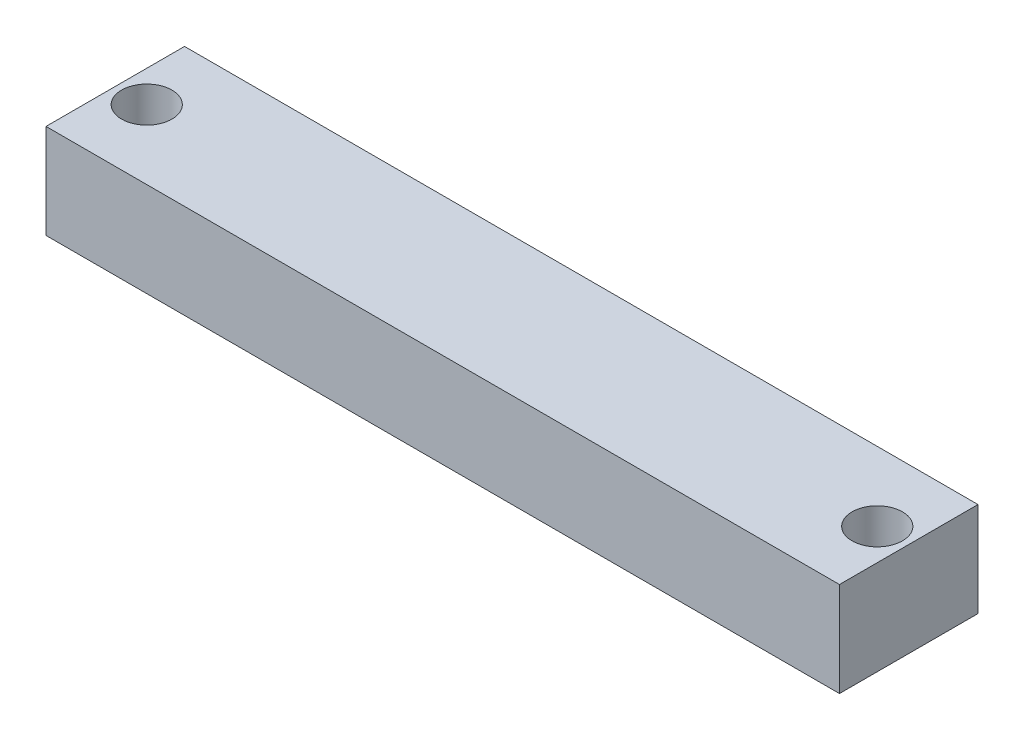
ISO-10303-21;
HEADER;
FILE_DESCRIPTION(('STEP AP214'),'2;1');
FILE_NAME('part.step','',(''),(''),'','','');
FILE_SCHEMA(('AUTOMOTIVE_DESIGN { 1 0 10303 214 1 1 1 1 }'));
ENDSEC;
DATA;
#1=APPLICATION_CONTEXT('core data for automotive mechanical design processes');
#2=APPLICATION_PROTOCOL_DEFINITION('international standard','automotive_design',2000,#1);
#3=PRODUCT_CONTEXT('',#1,'mechanical');
#4=PRODUCT('Part','Part','',(#3));
#5=PRODUCT_RELATED_PRODUCT_CATEGORY('part','',(#4));
#6=PRODUCT_DEFINITION_FORMATION('','',#4);
#7=PRODUCT_DEFINITION_CONTEXT('part definition',#1,'design');
#8=PRODUCT_DEFINITION('design','',#6,#7);
#9=PRODUCT_DEFINITION_SHAPE('','',#8);
#10=(LENGTH_UNIT() NAMED_UNIT(*) SI_UNIT(.MILLI.,.METRE.));
#11=(NAMED_UNIT(*) PLANE_ANGLE_UNIT() SI_UNIT($,.RADIAN.));
#12=(NAMED_UNIT(*) SI_UNIT($,.STERADIAN.) SOLID_ANGLE_UNIT());
#13=UNCERTAINTY_MEASURE_WITH_UNIT(LENGTH_MEASURE(1.E-05),#10,'distance_accuracy_value','');
#14=(GEOMETRIC_REPRESENTATION_CONTEXT(3) GLOBAL_UNCERTAINTY_ASSIGNED_CONTEXT((#13)) GLOBAL_UNIT_ASSIGNED_CONTEXT((#10,
#11,#12)) REPRESENTATION_CONTEXT('',''));
#15=CARTESIAN_POINT('',(0.,0.,0.));
#16=DIRECTION('',(0.,0.,1.));
#17=DIRECTION('',(1.,0.,0.));
#18=AXIS2_PLACEMENT_3D('',#15,#16,#17);
#19=CARTESIAN_POINT('',(0.,15.,0.));
#20=DIRECTION('',(1.,0.,0.));
#21=DIRECTION('',(0.,0.,-1.));
#22=AXIS2_PLACEMENT_3D('',#19,#20,#21);
#23=PLANE('',#22);
#24=CARTESIAN_POINT('',(0.,2.78146413392359,-11.2220487466389));
#25=DIRECTION('',(-1.,0.,0.));
#26=DIRECTION('',(0.,0.,1.));
#27=AXIS2_PLACEMENT_3D('',#24,#25,#26);
#28=CIRCLE('',#27,1.20091221248866);
#29=CARTESIAN_POINT('',(0.,2.78146413392359,-10.0211365341503));
#30=VERTEX_POINT('',#29);
#31=EDGE_CURVE('E150',#30,#30,#28,.T.);
#32=ORIENTED_EDGE('',*,*,#31,.F.);
#33=EDGE_LOOP('',(#32));
#34=FACE_BOUND('',#33,.T.);
#35=DIRECTION('',(0.,0.,1.));
#36=VECTOR('',#35,1.);
#37=CARTESIAN_POINT('',(0.,0.,0.));
#38=LINE('',#37,#36);
#39=CARTESIAN_POINT('',(0.,0.,-22.));
#40=VERTEX_POINT('',#39);
#41=CARTESIAN_POINT('',(0.,0.,0.));
#42=VERTEX_POINT('',#41);
#43=EDGE_CURVE('E106',#40,#42,#38,.T.);
#44=ORIENTED_EDGE('',*,*,#43,.T.);
#45=DIRECTION('',(0.,-1.,0.));
#46=VECTOR('',#45,1.);
#47=CARTESIAN_POINT('',(0.,15.,0.));
#48=LINE('',#47,#46);
#49=CARTESIAN_POINT('',(0.,15.,0.));
#50=VERTEX_POINT('',#49);
#51=EDGE_CURVE('E11',#50,#42,#48,.T.);
#52=ORIENTED_EDGE('',*,*,#51,.F.);
#53=DIRECTION('',(0.,0.,1.));
#54=VECTOR('',#53,1.);
#55=CARTESIAN_POINT('',(0.,15.,0.));
#56=LINE('',#55,#54);
#57=CARTESIAN_POINT('',(0.,15.,-22.));
#58=VERTEX_POINT('',#57);
#59=EDGE_CURVE('E93',#58,#50,#56,.T.);
#60=ORIENTED_EDGE('',*,*,#59,.F.);
#61=DIRECTION('',(0.,-1.,0.));
#62=VECTOR('',#61,1.);
#63=CARTESIAN_POINT('',(0.,15.,-22.));
#64=LINE('',#63,#62);
#65=EDGE_CURVE('E102',#58,#40,#64,.T.);
#66=ORIENTED_EDGE('',*,*,#65,.T.);
#67=EDGE_LOOP('',(#44,#52,#60,#66));
#68=FACE_BOUND('',#67,.T.);
#69=ADVANCED_FACE('F35',(#34,#68),#23,.F.);
#70=CARTESIAN_POINT('',(0.,15.,0.));
#71=DIRECTION('',(0.,0.,-1.));
#72=DIRECTION('',(-1.,0.,0.));
#73=AXIS2_PLACEMENT_3D('',#70,#71,#72);
#74=PLANE('',#73);
#75=DIRECTION('',(1.,0.,0.));
#76=VECTOR('',#75,1.);
#77=CARTESIAN_POINT('',(0.,0.,0.));
#78=LINE('',#77,#76);
#79=CARTESIAN_POINT('',(126.,0.,0.));
#80=VERTEX_POINT('',#79);
#81=EDGE_CURVE('E97',#42,#80,#78,.T.);
#82=ORIENTED_EDGE('',*,*,#81,.T.);
#83=DIRECTION('',(0.,-1.,0.));
#84=VECTOR('',#83,1.);
#85=CARTESIAN_POINT('',(126.,15.,0.));
#86=LINE('',#85,#84);
#87=CARTESIAN_POINT('',(126.,15.,0.));
#88=VERTEX_POINT('',#87);
#89=EDGE_CURVE('E49',#88,#80,#86,.T.);
#90=ORIENTED_EDGE('',*,*,#89,.F.);
#91=DIRECTION('',(1.,0.,0.));
#92=VECTOR('',#91,1.);
#93=CARTESIAN_POINT('',(0.,15.,0.));
#94=LINE('',#93,#92);
#95=EDGE_CURVE('E88',#50,#88,#94,.T.);
#96=ORIENTED_EDGE('',*,*,#95,.F.);
#97=ORIENTED_EDGE('',*,*,#51,.T.);
#98=EDGE_LOOP('',(#82,#90,#96,#97));
#99=FACE_BOUND('',#98,.T.);
#100=ADVANCED_FACE('F96',(#99),#74,.F.);
#101=CARTESIAN_POINT('',(126.,15.,0.));
#102=DIRECTION('',(-1.,0.,0.));
#103=DIRECTION('',(0.,0.,1.));
#104=AXIS2_PLACEMENT_3D('',#101,#102,#103);
#105=PLANE('',#104);
#106=DIRECTION('',(0.,0.,-1.));
#107=VECTOR('',#106,1.);
#108=CARTESIAN_POINT('',(126.,0.,0.));
#109=LINE('',#108,#107);
#110=CARTESIAN_POINT('',(126.,0.,-22.));
#111=VERTEX_POINT('',#110);
#112=EDGE_CURVE('E75',#80,#111,#109,.T.);
#113=ORIENTED_EDGE('',*,*,#112,.T.);
#114=DIRECTION('',(0.,-1.,0.));
#115=VECTOR('',#114,1.);
#116=CARTESIAN_POINT('',(126.,15.,-22.));
#117=LINE('',#116,#115);
#118=CARTESIAN_POINT('',(126.,15.,-22.));
#119=VERTEX_POINT('',#118);
#120=EDGE_CURVE('E98',#119,#111,#117,.T.);
#121=ORIENTED_EDGE('',*,*,#120,.F.);
#122=DIRECTION('',(0.,0.,-1.));
#123=VECTOR('',#122,1.);
#124=CARTESIAN_POINT('',(126.,15.,0.));
#125=LINE('',#124,#123);
#126=EDGE_CURVE('E91',#88,#119,#125,.T.);
#127=ORIENTED_EDGE('',*,*,#126,.F.);
#128=ORIENTED_EDGE('',*,*,#89,.T.);
#129=EDGE_LOOP('',(#113,#121,#127,#128));
#130=FACE_BOUND('',#129,.T.);
#131=ADVANCED_FACE('F100',(#130),#105,.F.);
#132=CARTESIAN_POINT('',(0.,15.,-22.));
#133=DIRECTION('',(0.,0.,1.));
#134=DIRECTION('',(1.,0.,0.));
#135=AXIS2_PLACEMENT_3D('',#132,#133,#134);
#136=PLANE('',#135);
#137=DIRECTION('',(-1.,0.,0.));
#138=VECTOR('',#137,1.);
#139=CARTESIAN_POINT('',(0.,0.,-22.));
#140=LINE('',#139,#138);
#141=EDGE_CURVE('E81',#111,#40,#140,.T.);
#142=ORIENTED_EDGE('',*,*,#141,.T.);
#143=ORIENTED_EDGE('',*,*,#65,.F.);
#144=DIRECTION('',(-1.,0.,0.));
#145=VECTOR('',#144,1.);
#146=CARTESIAN_POINT('',(0.,15.,-22.));
#147=LINE('',#146,#145);
#148=EDGE_CURVE('E58',#119,#58,#147,.T.);
#149=ORIENTED_EDGE('',*,*,#148,.F.);
#150=ORIENTED_EDGE('',*,*,#120,.T.);
#151=EDGE_LOOP('',(#142,#143,#149,#150));
#152=FACE_BOUND('',#151,.T.);
#153=ADVANCED_FACE('F162',(#152),#136,.F.);
#154=CARTESIAN_POINT('',(0.,15.,0.));
#155=DIRECTION('',(0.,-1.,0.));
#156=DIRECTION('',(0.,0.,-1.));
#157=AXIS2_PLACEMENT_3D('',#154,#155,#156);
#158=PLANE('',#157);
#159=CARTESIAN_POINT('',(5.,15.,-11.));
#160=DIRECTION('',(0.,1.,0.));
#161=DIRECTION('',(0.,0.,1.));
#162=AXIS2_PLACEMENT_3D('',#159,#160,#161);
#163=CIRCLE('',#162,4.);
#164=CARTESIAN_POINT('',(5.,15.,-7.));
#165=VERTEX_POINT('',#164);
#166=EDGE_CURVE('E236',#165,#165,#163,.T.);
#167=ORIENTED_EDGE('',*,*,#166,.F.);
#168=EDGE_LOOP('',(#167));
#169=FACE_BOUND('',#168,.T.);
#170=CARTESIAN_POINT('',(121.,15.,-11.));
#171=DIRECTION('',(0.,1.,0.));
#172=DIRECTION('',(0.,0.,-1.));
#173=AXIS2_PLACEMENT_3D('',#170,#171,#172);
#174=CIRCLE('',#173,4.00000000000002);
#175=CARTESIAN_POINT('',(121.,15.,-15.));
#176=VERTEX_POINT('',#175);
#177=EDGE_CURVE('E237',#176,#176,#174,.T.);
#178=ORIENTED_EDGE('',*,*,#177,.F.);
#179=EDGE_LOOP('',(#178));
#180=FACE_BOUND('',#179,.T.);
#181=ORIENTED_EDGE('',*,*,#59,.T.);
#182=ORIENTED_EDGE('',*,*,#95,.T.);
#183=ORIENTED_EDGE('',*,*,#126,.T.);
#184=ORIENTED_EDGE('',*,*,#148,.T.);
#185=EDGE_LOOP('',(#181,#182,#183,#184));
#186=FACE_BOUND('',#185,.T.);
#187=ADVANCED_FACE('F89',(#169,#180,#186),#158,.F.);
#188=CARTESIAN_POINT('',(0.,0.,0.));
#189=DIRECTION('',(0.,-1.,0.));
#190=DIRECTION('',(0.,0.,-1.));
#191=AXIS2_PLACEMENT_3D('',#188,#189,#190);
#192=PLANE('',#191);
#193=CARTESIAN_POINT('',(5.,0.,-11.));
#194=DIRECTION('',(0.,1.,0.));
#195=DIRECTION('',(0.,0.,1.));
#196=AXIS2_PLACEMENT_3D('',#193,#194,#195);
#197=CIRCLE('',#196,4.);
#198=CARTESIAN_POINT('',(5.,0.,-7.));
#199=VERTEX_POINT('',#198);
#200=EDGE_CURVE('E119',#199,#199,#197,.T.);
#201=ORIENTED_EDGE('',*,*,#200,.T.);
#202=EDGE_LOOP('',(#201));
#203=FACE_BOUND('',#202,.T.);
#204=CARTESIAN_POINT('',(121.,0.,-11.));
#205=DIRECTION('',(0.,1.,0.));
#206=DIRECTION('',(0.,0.,-1.));
#207=AXIS2_PLACEMENT_3D('',#204,#205,#206);
#208=CIRCLE('',#207,4.00000000000002);
#209=CARTESIAN_POINT('',(121.,0.,-15.));
#210=VERTEX_POINT('',#209);
#211=EDGE_CURVE('E235',#210,#210,#208,.T.);
#212=ORIENTED_EDGE('',*,*,#211,.T.);
#213=EDGE_LOOP('',(#212));
#214=FACE_BOUND('',#213,.T.);
#215=ORIENTED_EDGE('',*,*,#43,.F.);
#216=ORIENTED_EDGE('',*,*,#141,.F.);
#217=ORIENTED_EDGE('',*,*,#112,.F.);
#218=ORIENTED_EDGE('',*,*,#81,.F.);
#219=EDGE_LOOP('',(#215,#216,#217,#218));
#220=FACE_BOUND('',#219,.T.);
#221=ADVANCED_FACE('F153',(#203,#214,#220),#192,.T.);
#222=CARTESIAN_POINT('',(10.,2.78146413392359,-11.2220487466389));
#223=DIRECTION('',(-1.,0.,0.));
#224=DIRECTION('',(0.,0.,1.));
#225=AXIS2_PLACEMENT_3D('',#222,#223,#224);
#226=CYLINDRICAL_SURFACE('',#225,1.20091221248866);
#227=CARTESIAN_POINT('',(1.12162065867396,2.78146413392359,-10.0211365341503));
#228=CARTESIAN_POINT('',(1.12162000781427,2.71500590461653,-10.0211373873862));
#229=CARTESIAN_POINT('',(1.12021123116829,2.64853914322629,-10.0266704733582));
#230=CARTESIAN_POINT('',(1.11477228940887,2.51752808274157,-10.0486167946235));
#231=CARTESIAN_POINT('',(1.11074131921783,2.45298438044017,-10.0650333714444));
#232=CARTESIAN_POINT('',(1.10062068112196,2.32771326591407,-10.108188557675));
#233=CARTESIAN_POINT('',(1.09453347596052,2.26698139098194,-10.1349148246259));
#234=CARTESIAN_POINT('',(1.08111251311755,2.15083812879796,-10.1979066270437));
#235=CARTESIAN_POINT('',(1.07377861755868,2.09542733109088,-10.2341732178629));
#236=CARTESIAN_POINT('',(1.05867888153301,1.9903065171688,-10.3160766397637));
#237=CARTESIAN_POINT('',(1.05090739671224,1.94072928475722,-10.3618829548809));
#238=CARTESIAN_POINT('',(1.03613487320452,1.84987876771616,-10.4612143463586));
#239=CARTESIAN_POINT('',(1.02913386572086,1.80860581934306,-10.5147397351286));
#240=CARTESIAN_POINT('',(1.01687643469327,1.73528431330221,-10.6284942865662));
#241=CARTESIAN_POINT('',(1.01163228465429,1.70330085061848,-10.6887668410225));
#242=CARTESIAN_POINT('',(1.00383509476027,1.64995302521631,-10.8140019897222));
#243=CARTESIAN_POINT('',(1.00128142106995,1.62858616201559,-10.8789634754697));
#244=CARTESIAN_POINT('',(0.99949401412369,1.59763811803491,-11.0096350265024));
#245=CARTESIAN_POINT('',(1.00016366209775,1.58772485681307,-11.0752651652628));
#246=CARTESIAN_POINT('',(1.00482240024859,1.57882784561008,-11.2071390439119));
#247=CARTESIAN_POINT('',(1.00881106756672,1.5798427035319,-11.273382704572));
#248=CARTESIAN_POINT('',(1.01985353994248,1.59254256774004,-11.4032365353339));
#249=CARTESIAN_POINT('',(1.02684539855025,1.60401692747889,-11.4668728768074));
#250=CARTESIAN_POINT('',(1.04342938639247,1.63687996065213,-11.5911715527187));
#251=CARTESIAN_POINT('',(1.05302185144804,1.65826991475901,-11.6518335018723));
#252=CARTESIAN_POINT('',(1.07438154968803,1.71094623081769,-11.7702161731388));
#253=CARTESIAN_POINT('',(1.08619868471873,1.74247461390025,-11.8278199883032));
#254=CARTESIAN_POINT('',(1.1108894597729,1.81434551055046,-11.9369934801085));
#255=CARTESIAN_POINT('',(1.12376341287625,1.85469064198548,-11.9885613575615));
#256=CARTESIAN_POINT('',(1.15006475482384,1.94516762929766,-12.0865949716262));
#257=CARTESIAN_POINT('',(1.16349155153087,1.99565220077971,-12.1327360571271));
#258=CARTESIAN_POINT('',(1.18904040804034,2.10393096364403,-12.2159300688496));
#259=CARTESIAN_POINT('',(1.20116238475081,2.16172562002912,-12.2529824164854));
#260=CARTESIAN_POINT('',(1.22282672788938,2.28317100966014,-12.3168539660409));
#261=CARTESIAN_POINT('',(1.23236950665385,2.34682080466166,-12.3436748039545));
#262=CARTESIAN_POINT('',(1.24776000675604,2.47817626159898,-12.3860775442457));
#263=CARTESIAN_POINT('',(1.25360960295374,2.54587984646762,-12.4016651497913));
#264=CARTESIAN_POINT('',(1.26067330230164,2.67932761923112,-12.4203979121875));
#265=CARTESIAN_POINT('',(1.26212951211421,2.74496799155063,-12.4241932836753));
#266=CARTESIAN_POINT('',(1.26092510684619,2.87594355755762,-12.4210286353939));
#267=CARTESIAN_POINT('',(1.25826520547694,2.94127880218242,-12.4140704802281));
#268=CARTESIAN_POINT('',(1.24930114546967,3.06747998945148,-12.3901118553893));
#269=CARTESIAN_POINT('',(1.24312433916429,3.12842236278261,-12.3734618927124));
#270=CARTESIAN_POINT('',(1.22786987201977,3.24663194191022,-12.3309921807109));
#271=CARTESIAN_POINT('',(1.2187916792577,3.30389847148575,-12.3051707498471));
#272=CARTESIAN_POINT('',(1.19822257292784,3.41548375044815,-12.2440111291315));
#273=CARTESIAN_POINT('',(1.18665439650791,3.46961329411268,-12.2083543319915));
#274=CARTESIAN_POINT('',(1.1624023205405,3.57130936189008,-12.1289661166432));
#275=CARTESIAN_POINT('',(1.14971806569866,3.61887378358249,-12.0852321222209));
#276=CARTESIAN_POINT('',(1.12361039691366,3.70884554454481,-11.9880633024116));
#277=CARTESIAN_POINT('',(1.11018535477491,3.7508151269065,-11.9342224727311));
#278=CARTESIAN_POINT('',(1.08451721090637,3.82514732107537,-11.8200101120712));
#279=CARTESIAN_POINT('',(1.07227416411413,3.85750948648767,-11.7596382778157));
#280=CARTESIAN_POINT('',(1.04999811769365,3.91170359768589,-11.6337051863473));
#281=CARTESIAN_POINT('',(1.03997234680424,3.93350136890289,-11.5681278756799));
#282=CARTESIAN_POINT('',(1.0230207387613,3.96556718583397,-11.433830828803));
#283=CARTESIAN_POINT('',(1.01609388388072,3.9758390185001,-11.365112132452));
#284=CARTESIAN_POINT('',(1.00604830750513,3.98418263274495,-11.2296934707658));
#285=CARTESIAN_POINT('',(1.00277661649342,3.98276717211538,-11.1630362475379));
#286=CARTESIAN_POINT('',(0.999572039538814,3.96891192207298,-11.0308012639251));
#287=CARTESIAN_POINT('',(0.999638686710795,3.95647367449709,-10.9652233538755));
#288=CARTESIAN_POINT('',(1.00276393598901,3.9213984353649,-10.8387192690214));
#289=CARTESIAN_POINT('',(1.00574735616686,3.89902541980141,-10.7777176314066));
#290=CARTESIAN_POINT('',(1.01402029160143,3.84482998557127,-10.6602400159946));
#291=CARTESIAN_POINT('',(1.01931004834589,3.81300657750122,-10.603764512845));
#292=CARTESIAN_POINT('',(1.0315419561741,3.74004732146501,-10.4956536998709));
#293=CARTESIAN_POINT('',(1.03851624423052,3.69873123200476,-10.4441437794934));
#294=CARTESIAN_POINT('',(1.05309844890688,3.60828037428197,-10.348610661066));
#295=CARTESIAN_POINT('',(1.06070652450452,3.55914364147685,-10.3045893499153));
#296=CARTESIAN_POINT('',(1.07578070221956,3.45272827075805,-10.2239594771367));
#297=CARTESIAN_POINT('',(1.08323579515268,3.39525044611943,-10.1876112805202));
#298=CARTESIAN_POINT('',(1.09672653947669,3.27486699681747,-10.1250799396311));
#299=CARTESIAN_POINT('',(1.10276269317697,3.21196330374227,-10.0988931960263));
#300=CARTESIAN_POINT('',(1.11212649747966,3.08831580773101,-10.0593540336945));
#301=CARTESIAN_POINT('',(1.11564899227471,3.02788697508913,-10.0450587797433));
#302=CARTESIAN_POINT('',(1.12039621972319,2.90546247178219,-10.0259502788531));
#303=CARTESIAN_POINT('',(1.12162126590013,2.84346701607826,-10.0211357381151));
#304=CARTESIAN_POINT('',(1.12162065867396,2.78146413392359,-10.0211365341503));
#305=B_SPLINE_CURVE_WITH_KNOTS('',3,(#227,#228,#229,#230,#231,#232,#233,#234,#235,#236,#237,
#238,#239,#240,#241,#242,#243,#244,#245,#246,#247,#248,#249,#250,#251,#252,#253,#254,#255,#256,
#257,#258,#259,#260,#261,#262,#263,#264,#265,#266,#267,#268,#269,#270,#271,#272,#273,#274,#275,
#276,#277,#278,#279,#280,#281,#282,#283,#284,#285,#286,#287,#288,#289,#290,#291,#292,#293,#294,
#295,#296,#297,#298,#299,#300,#301,#302,#303,#304),.UNSPECIFIED.,.T.,.F.,(4,2,2,2,2,2,2,2,2,2,2,
2,2,2,2,2,2,2,2,2,2,2,2,2,2,2,2,2,2,2,2,2,2,2,2,2,2,2,4),(0.,0.199148569529685,
0.398358311420701,0.597330301707458,0.796324311573894,0.999212583913703,1.20210906993599,
1.40639480160516,1.61063239589515,1.80878678464897,2.00691593146801,2.2011409949177,
2.39539115096594,2.59467355228626,2.79401520509219,3.00213453759115,3.21026711546179,
3.41836639946956,3.62635995585864,3.82266074228303,4.01892749503094,4.20850205428471,
4.39811138896661,4.59478209484173,4.79151563731013,4.99926247237306,5.20701895858544,
5.4154430996277,5.62379874095096,5.82306340563751,6.02230020213274,6.21653336991616,
6.4107868800026,6.60908842237376,6.80743985686352,7.01170952252137,7.21590676674645,
7.40172981411797,7.58752750112481),.UNSPECIFIED.);
#306=CARTESIAN_POINT('',(1.12162065867396,2.78146413392359,-10.0211365341503));
#307=VERTEX_POINT('',#306);
#308=EDGE_CURVE('E114',#307,#307,#305,.T.);
#309=ORIENTED_EDGE('',*,*,#308,.T.);
#310=EDGE_LOOP('',(#309));
#311=FACE_BOUND('',#310,.T.);
#312=ORIENTED_EDGE('',*,*,#31,.T.);
#313=EDGE_LOOP('',(#312));
#314=FACE_BOUND('',#313,.T.);
#315=ADVANCED_FACE('F120',(#311,#314),#226,.F.);
#316=CARTESIAN_POINT('',(5.,0.,-11.));
#317=DIRECTION('',(0.,1.,0.));
#318=DIRECTION('',(0.,0.,1.));
#319=AXIS2_PLACEMENT_3D('',#316,#317,#318);
#320=CYLINDRICAL_SURFACE('',#319,4.);
#321=ORIENTED_EDGE('',*,*,#308,.F.);
#322=EDGE_LOOP('',(#321));
#323=FACE_BOUND('',#322,.T.);
#324=ORIENTED_EDGE('',*,*,#200,.F.);
#325=EDGE_LOOP('',(#324));
#326=FACE_BOUND('',#325,.T.);
#327=ORIENTED_EDGE('',*,*,#166,.T.);
#328=EDGE_LOOP('',(#327));
#329=FACE_BOUND('',#328,.T.);
#330=CARTESIAN_POINT('',(8.87837934132604,2.78146413392359,-10.0211365341503));
#331=CARTESIAN_POINT('',(8.87837999218573,2.84792236323064,-10.0211373873862));
#332=CARTESIAN_POINT('',(8.87978876883171,2.91438912462089,-10.0266704733582));
#333=CARTESIAN_POINT('',(8.88522771059113,3.04540018510561,-10.0486167946235));
#334=CARTESIAN_POINT('',(8.88925868078217,3.109943887407,-10.0650333714444));
#335=CARTESIAN_POINT('',(8.89937931887804,3.23521500193311,-10.108188557675));
#336=CARTESIAN_POINT('',(8.90546652403948,3.29594687686524,-10.1349148246259));
#337=CARTESIAN_POINT('',(8.91888748688245,3.41209013904922,-10.1979066270437));
#338=CARTESIAN_POINT('',(8.92622138244132,3.4675009367563,-10.2341732178629));
#339=CARTESIAN_POINT('',(8.94132111846699,3.57262175067838,-10.3160766397637));
#340=CARTESIAN_POINT('',(8.94909260328776,3.62219898308996,-10.3618829548809));
#341=CARTESIAN_POINT('',(8.96386512679548,3.71304950013102,-10.4612143463586));
#342=CARTESIAN_POINT('',(8.97086613427914,3.75432244850412,-10.5147397351286));
#343=CARTESIAN_POINT('',(8.98312356530673,3.82764395454497,-10.6284942865662));
#344=CARTESIAN_POINT('',(8.98836771534571,3.8596274172287,-10.6887668410225));
#345=CARTESIAN_POINT('',(8.99616490523973,3.91297524263086,-10.8140019897222));
#346=CARTESIAN_POINT('',(8.99871857893005,3.93434210583158,-10.8789634754697));
#347=CARTESIAN_POINT('',(9.00050598587631,3.96529014981227,-11.0096350265024));
#348=CARTESIAN_POINT('',(8.99983633790225,3.97520341103411,-11.0752651652628));
#349=CARTESIAN_POINT('',(8.99517759975141,3.9841004222371,-11.2071390439119));
#350=CARTESIAN_POINT('',(8.99118893243327,3.98308556431528,-11.273382704572));
#351=CARTESIAN_POINT('',(8.98014646005752,3.97038570010714,-11.4032365353339));
#352=CARTESIAN_POINT('',(8.97315460144975,3.95891134036829,-11.4668728768074));
#353=CARTESIAN_POINT('',(8.95657061360753,3.92604830719505,-11.5911715527187));
#354=CARTESIAN_POINT('',(8.94697814855196,3.90465835308817,-11.6518335018723));
#355=CARTESIAN_POINT('',(8.92561845031197,3.85198203702948,-11.7702161731388));
#356=CARTESIAN_POINT('',(8.91380131528128,3.82045365394693,-11.8278199883032));
#357=CARTESIAN_POINT('',(8.8891105402271,3.74858275729672,-11.9369934801085));
#358=CARTESIAN_POINT('',(8.87623658712375,3.7082376258617,-11.9885613575615));
#359=CARTESIAN_POINT('',(8.84993524517616,3.61776063854952,-12.0865949716262));
#360=CARTESIAN_POINT('',(8.83650844846913,3.56727606706747,-12.1327360571271));
#361=CARTESIAN_POINT('',(8.81095959195966,3.45899730420315,-12.2159300688496));
#362=CARTESIAN_POINT('',(8.79883761524919,3.40120264781806,-12.2529824164854));
#363=CARTESIAN_POINT('',(8.77717327211062,3.27975725818704,-12.3168539660409));
#364=CARTESIAN_POINT('',(8.76763049334615,3.21610746318551,-12.3436748039545));
#365=CARTESIAN_POINT('',(8.75223999324396,3.0847520062482,-12.3860775442457));
#366=CARTESIAN_POINT('',(8.74639039704626,3.01704842137956,-12.4016651497913));
#367=CARTESIAN_POINT('',(8.73932669769836,2.88360064861606,-12.4203979121875));
#368=CARTESIAN_POINT('',(8.73787048788579,2.81796027629655,-12.4241932836753));
#369=CARTESIAN_POINT('',(8.73907489315381,2.68698471028956,-12.4210286353939));
#370=CARTESIAN_POINT('',(8.74173479452307,2.62164946566476,-12.4140704802281));
#371=CARTESIAN_POINT('',(8.75069885453033,2.4954482783957,-12.3901118553893));
#372=CARTESIAN_POINT('',(8.75687566083571,2.43450590506456,-12.3734618927124));
#373=CARTESIAN_POINT('',(8.77213012798023,2.31629632593696,-12.3309921807109));
#374=CARTESIAN_POINT('',(8.7812083207423,2.25902979636143,-12.3051707498471));
#375=CARTESIAN_POINT('',(8.80177742707217,2.14744451739903,-12.2440111291315));
#376=CARTESIAN_POINT('',(8.8133456034921,2.0933149737345,-12.2083543319915));
#377=CARTESIAN_POINT('',(8.8375976794595,1.9916189059571,-12.1289661166432));
#378=CARTESIAN_POINT('',(8.85028193430134,1.94405448426469,-12.0852321222209));
#379=CARTESIAN_POINT('',(8.87638960308633,1.85408272330237,-11.9880633024116));
#380=CARTESIAN_POINT('',(8.88981464522509,1.81211314094068,-11.9342224727311));
#381=CARTESIAN_POINT('',(8.91548278909363,1.73778094677181,-11.8200101120712));
#382=CARTESIAN_POINT('',(8.92772583588587,1.70541878135951,-11.7596382778157));
#383=CARTESIAN_POINT('',(8.95000188230635,1.65122467016129,-11.6337051863473));
#384=CARTESIAN_POINT('',(8.96002765319576,1.62942689894429,-11.5681278756799));
#385=CARTESIAN_POINT('',(8.9769792612387,1.59736108201321,-11.433830828803));
#386=CARTESIAN_POINT('',(8.98390611611928,1.58708924934708,-11.365112132452));
#387=CARTESIAN_POINT('',(8.99395169249487,1.57874563510223,-11.2296934707658));
#388=CARTESIAN_POINT('',(8.99722338350658,1.58016109573179,-11.1630362475379));
#389=CARTESIAN_POINT('',(9.00042796046119,1.59401634577419,-11.0308012639251));
#390=CARTESIAN_POINT('',(9.00036131328921,1.60645459335009,-10.9652233538755));
#391=CARTESIAN_POINT('',(8.99723606401099,1.64152983248228,-10.8387192690214));
#392=CARTESIAN_POINT('',(8.99425264383314,1.66390284804577,-10.7777176314066));
#393=CARTESIAN_POINT('',(8.98597970839857,1.71809828227591,-10.6602400159946));
#394=CARTESIAN_POINT('',(8.98068995165411,1.74992169034596,-10.603764512845));
#395=CARTESIAN_POINT('',(8.9684580438259,1.82288094638217,-10.4956536998709));
#396=CARTESIAN_POINT('',(8.96148375576948,1.86419703584242,-10.4441437794934));
#397=CARTESIAN_POINT('',(8.94690155109312,1.95464789356521,-10.348610661066));
#398=CARTESIAN_POINT('',(8.93929347549548,2.00378462637033,-10.3045893499153));
#399=CARTESIAN_POINT('',(8.92421929778044,2.11019999708913,-10.2239594771367));
#400=CARTESIAN_POINT('',(8.91676420484731,2.16767782172775,-10.1876112805202));
#401=CARTESIAN_POINT('',(8.90327346052331,2.28806127102971,-10.1250799396311));
#402=CARTESIAN_POINT('',(8.89723730682303,2.35096496410491,-10.0988931960263));
#403=CARTESIAN_POINT('',(8.88787350252034,2.47461246011617,-10.0593540336945));
#404=CARTESIAN_POINT('',(8.88435100772529,2.53504129275805,-10.0450587797433));
#405=CARTESIAN_POINT('',(8.87960378027681,2.65746579606499,-10.0259502788531));
#406=CARTESIAN_POINT('',(8.87837873409987,2.71946125176891,-10.0211357381151));
#407=CARTESIAN_POINT('',(8.87837934132604,2.78146413392359,-10.0211365341503));
#408=B_SPLINE_CURVE_WITH_KNOTS('',3,(#330,#331,#332,#333,#334,#335,#336,#337,#338,#339,#340,
#341,#342,#343,#344,#345,#346,#347,#348,#349,#350,#351,#352,#353,#354,#355,#356,#357,#358,#359,
#360,#361,#362,#363,#364,#365,#366,#367,#368,#369,#370,#371,#372,#373,#374,#375,#376,#377,#378,
#379,#380,#381,#382,#383,#384,#385,#386,#387,#388,#389,#390,#391,#392,#393,#394,#395,#396,#397,
#398,#399,#400,#401,#402,#403,#404,#405,#406,#407),.UNSPECIFIED.,.T.,.F.,(4,2,2,2,2,2,2,2,2,2,2,
2,2,2,2,2,2,2,2,2,2,2,2,2,2,2,2,2,2,2,2,2,2,2,2,2,2,2,4),(0.,0.199148569529685,
0.398358311420701,0.597330301707458,0.796324311573894,0.999212583913701,1.20210906993599,
1.40639480160516,1.61063239589515,1.80878678464897,2.00691593146801,2.2011409949177,
2.39539115096594,2.59467355228626,2.79401520509219,3.00213453759115,3.21026711546179,
3.41836639946956,3.62635995585864,3.82266074228303,4.01892749503094,4.20850205428472,
4.39811138896661,4.59478209484173,4.79151563731013,4.99926247237306,5.20701895858544,
5.4154430996277,5.62379874095096,5.82306340563751,6.02230020213274,6.21653336991616,
6.41078688000261,6.60908842237376,6.80743985686352,7.01170952252137,7.21590676674645,
7.40172981411797,7.58752750112481),.UNSPECIFIED.);
#409=CARTESIAN_POINT('',(8.87837934132604,2.78146413392359,-10.0211365341503));
#410=VERTEX_POINT('',#409);
#411=EDGE_CURVE('E38',#410,#410,#408,.T.);
#412=ORIENTED_EDGE('',*,*,#411,.F.);
#413=EDGE_LOOP('',(#412));
#414=FACE_BOUND('',#413,.T.);
#415=ADVANCED_FACE('F124',(#323,#326,#329,#414),#320,.F.);
#416=CARTESIAN_POINT('',(10.,2.78146413392359,-11.2220487466389));
#417=DIRECTION('',(-1.,0.,0.));
#418=DIRECTION('',(0.,0.,1.));
#419=AXIS2_PLACEMENT_3D('',#416,#417,#418);
#420=PLANE('',#419);
#421=CARTESIAN_POINT('',(10.,2.78146413392359,-11.2220487466389));
#422=DIRECTION('',(-1.,0.,0.));
#423=DIRECTION('',(0.,0.,1.));
#424=AXIS2_PLACEMENT_3D('',#421,#422,#423);
#425=CIRCLE('',#424,1.20091221248866);
#426=CARTESIAN_POINT('',(10.,2.78146413392359,-10.0211365341503));
#427=VERTEX_POINT('',#426);
#428=EDGE_CURVE('E109',#427,#427,#425,.T.);
#429=ORIENTED_EDGE('',*,*,#428,.T.);
#430=EDGE_LOOP('',(#429));
#431=FACE_BOUND('',#430,.T.);
#432=ADVANCED_FACE('F128',(#431),#420,.T.);
#433=ORIENTED_EDGE('',*,*,#411,.T.);
#434=EDGE_LOOP('',(#433));
#435=FACE_BOUND('',#434,.T.);
#436=ORIENTED_EDGE('',*,*,#428,.F.);
#437=EDGE_LOOP('',(#436));
#438=FACE_BOUND('',#437,.T.);
#439=ADVANCED_FACE('F133',(#435,#438),#226,.F.);
#440=CARTESIAN_POINT('',(121.,0.,-11.));
#441=DIRECTION('',(0.,1.,0.));
#442=DIRECTION('',(0.,0.,1.));
#443=AXIS2_PLACEMENT_3D('',#440,#441,#442);
#444=CYLINDRICAL_SURFACE('',#443,4.00000000000002);
#445=ORIENTED_EDGE('',*,*,#211,.F.);
#446=EDGE_LOOP('',(#445));
#447=FACE_BOUND('',#446,.T.);
#448=ORIENTED_EDGE('',*,*,#177,.T.);
#449=EDGE_LOOP('',(#448));
#450=FACE_BOUND('',#449,.T.);
#451=ADVANCED_FACE('F130',(#447,#450),#444,.F.);
#452=CLOSED_SHELL('',(#69,#100,#131,#153,#187,#221,#315,#415,#432,#439,#451));
#453=MANIFOLD_SOLID_BREP('B2',#452);
#454=ADVANCED_BREP_SHAPE_REPRESENTATION('',(#18,#453),#14);
#455=SHAPE_DEFINITION_REPRESENTATION(#9,#454);
ENDSEC;
END-ISO-10303-21;
